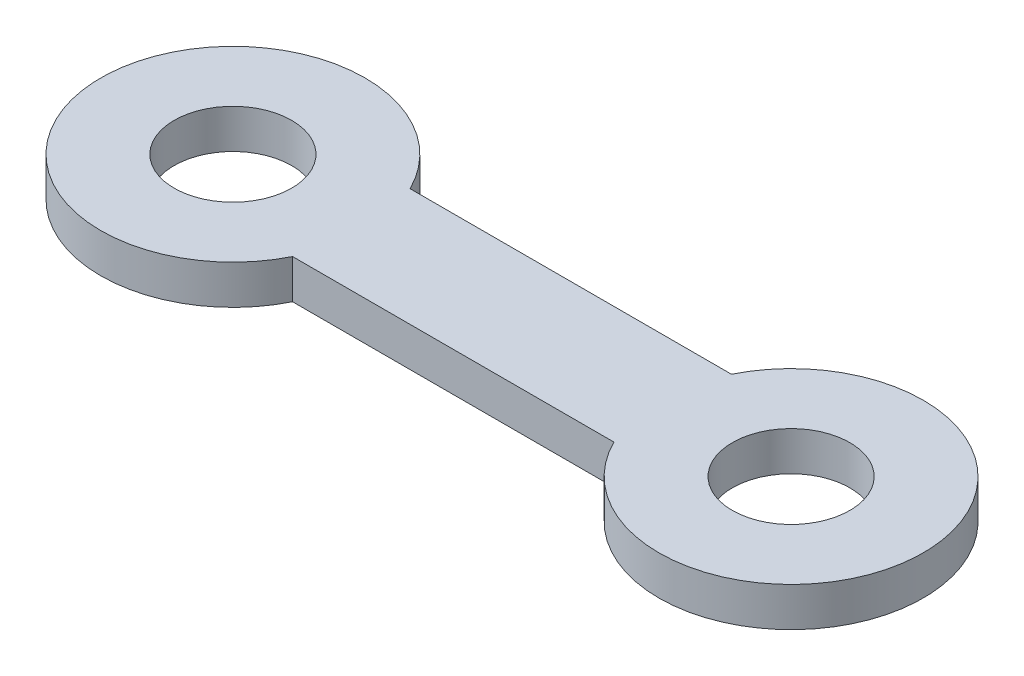
ISO-10303-21;
HEADER;
FILE_DESCRIPTION(('STEP AP214'),'2;1');
FILE_NAME('part.step','',(''),(''),'','','');
FILE_SCHEMA(('AUTOMOTIVE_DESIGN { 1 0 10303 214 1 1 1 1 }'));
ENDSEC;
DATA;
#1=APPLICATION_CONTEXT('core data for automotive mechanical design processes');
#2=APPLICATION_PROTOCOL_DEFINITION('international standard','automotive_design',2000,#1);
#3=PRODUCT_CONTEXT('',#1,'mechanical');
#4=PRODUCT('Part','Part','',(#3));
#5=PRODUCT_RELATED_PRODUCT_CATEGORY('part','',(#4));
#6=PRODUCT_DEFINITION_FORMATION('','',#4);
#7=PRODUCT_DEFINITION_CONTEXT('part definition',#1,'design');
#8=PRODUCT_DEFINITION('design','',#6,#7);
#9=PRODUCT_DEFINITION_SHAPE('','',#8);
#10=(LENGTH_UNIT() NAMED_UNIT(*) SI_UNIT(.MILLI.,.METRE.));
#11=(NAMED_UNIT(*) PLANE_ANGLE_UNIT() SI_UNIT($,.RADIAN.));
#12=(NAMED_UNIT(*) SI_UNIT($,.STERADIAN.) SOLID_ANGLE_UNIT());
#13=UNCERTAINTY_MEASURE_WITH_UNIT(LENGTH_MEASURE(1.E-05),#10,'distance_accuracy_value','');
#14=(GEOMETRIC_REPRESENTATION_CONTEXT(3) GLOBAL_UNCERTAINTY_ASSIGNED_CONTEXT((#13)) GLOBAL_UNIT_ASSIGNED_CONTEXT((#10,
#11,#12)) REPRESENTATION_CONTEXT('',''));
#15=CARTESIAN_POINT('',(0.,0.,0.));
#16=DIRECTION('',(0.,0.,1.));
#17=DIRECTION('',(1.,0.,0.));
#18=AXIS2_PLACEMENT_3D('',#15,#16,#17);
#19=CARTESIAN_POINT('',(-14.25,1.,0.));
#20=DIRECTION('',(0.,-1.,0.));
#21=DIRECTION('',(0.,0.,-1.));
#22=AXIS2_PLACEMENT_3D('',#19,#20,#21);
#23=PLANE('',#22);
#24=CARTESIAN_POINT('',(-14.25,1.,0.));
#25=DIRECTION('',(0.,1.,0.));
#26=DIRECTION('',(0.,0.,-1.));
#27=AXIS2_PLACEMENT_3D('',#24,#25,#26);
#28=CIRCLE('',#27,3.375);
#29=CARTESIAN_POINT('',(-11.226653344388,1.,-1.5));
#30=VERTEX_POINT('',#29);
#31=CARTESIAN_POINT('',(-11.226653344388,1.,1.5));
#32=VERTEX_POINT('',#31);
#33=EDGE_CURVE('E92',#30,#32,#28,.T.);
#34=ORIENTED_EDGE('',*,*,#33,.T.);
#35=DIRECTION('',(1.,0.,0.));
#36=VECTOR('',#35,1.);
#37=CARTESIAN_POINT('',(-11.226653344388,1.,1.5));
#38=LINE('',#37,#36);
#39=CARTESIAN_POINT('',(-3.02334665561196,1.,1.5));
#40=VERTEX_POINT('',#39);
#41=EDGE_CURVE('E87',#32,#40,#38,.T.);
#42=ORIENTED_EDGE('',*,*,#41,.T.);
#43=CARTESIAN_POINT('',(0.,1.,0.));
#44=DIRECTION('',(0.,1.,0.));
#45=DIRECTION('',(0.,0.,1.));
#46=AXIS2_PLACEMENT_3D('',#43,#44,#45);
#47=CIRCLE('',#46,3.375);
#48=CARTESIAN_POINT('',(-3.02334665561196,1.,-1.5));
#49=VERTEX_POINT('',#48);
#50=EDGE_CURVE('E90',#40,#49,#47,.T.);
#51=ORIENTED_EDGE('',*,*,#50,.T.);
#52=DIRECTION('',(-1.,0.,0.));
#53=VECTOR('',#52,1.);
#54=CARTESIAN_POINT('',(-3.02334665561196,1.,-1.5));
#55=LINE('',#54,#53);
#56=EDGE_CURVE('E57',#49,#30,#55,.T.);
#57=ORIENTED_EDGE('',*,*,#56,.T.);
#58=EDGE_LOOP('',(#34,#42,#51,#57));
#59=FACE_BOUND('',#58,.T.);
#60=CARTESIAN_POINT('',(0.,1.,0.));
#61=DIRECTION('',(0.,1.,0.));
#62=DIRECTION('',(0.,0.,1.));
#63=AXIS2_PLACEMENT_3D('',#60,#61,#62);
#64=CIRCLE('',#63,1.5);
#65=CARTESIAN_POINT('',(0.,1.,1.5));
#66=VERTEX_POINT('',#65);
#67=EDGE_CURVE('E112',#66,#66,#64,.T.);
#68=ORIENTED_EDGE('',*,*,#67,.F.);
#69=EDGE_LOOP('',(#68));
#70=FACE_BOUND('',#69,.T.);
#71=CARTESIAN_POINT('',(-14.25,1.,0.));
#72=DIRECTION('',(0.,1.,0.));
#73=DIRECTION('',(0.,0.,-1.));
#74=AXIS2_PLACEMENT_3D('',#71,#72,#73);
#75=CIRCLE('',#74,1.5);
#76=CARTESIAN_POINT('',(-14.25,1.,-1.5));
#77=VERTEX_POINT('',#76);
#78=EDGE_CURVE('E134',#77,#77,#75,.T.);
#79=ORIENTED_EDGE('',*,*,#78,.F.);
#80=EDGE_LOOP('',(#79));
#81=FACE_BOUND('',#80,.T.);
#82=ADVANCED_FACE('F39',(#59,#70,#81),#23,.F.);
#83=CARTESIAN_POINT('',(-14.25,0.,0.));
#84=DIRECTION('',(0.,-1.,0.));
#85=DIRECTION('',(0.,0.,-1.));
#86=AXIS2_PLACEMENT_3D('',#83,#84,#85);
#87=PLANE('',#86);
#88=CARTESIAN_POINT('',(0.,0.,0.));
#89=DIRECTION('',(0.,1.,0.));
#90=DIRECTION('',(0.,0.,1.));
#91=AXIS2_PLACEMENT_3D('',#88,#89,#90);
#92=CIRCLE('',#91,1.5);
#93=CARTESIAN_POINT('',(0.,0.,1.5));
#94=VERTEX_POINT('',#93);
#95=EDGE_CURVE('E130',#94,#94,#92,.T.);
#96=ORIENTED_EDGE('',*,*,#95,.T.);
#97=EDGE_LOOP('',(#96));
#98=FACE_BOUND('',#97,.T.);
#99=CARTESIAN_POINT('',(-14.25,0.,0.));
#100=DIRECTION('',(0.,1.,0.));
#101=DIRECTION('',(0.,0.,-1.));
#102=AXIS2_PLACEMENT_3D('',#99,#100,#101);
#103=CIRCLE('',#102,3.375);
#104=CARTESIAN_POINT('',(-11.226653344388,0.,-1.5));
#105=VERTEX_POINT('',#104);
#106=CARTESIAN_POINT('',(-11.226653344388,0.,1.5));
#107=VERTEX_POINT('',#106);
#108=EDGE_CURVE('E108',#105,#107,#103,.T.);
#109=ORIENTED_EDGE('',*,*,#108,.F.);
#110=DIRECTION('',(-1.,0.,0.));
#111=VECTOR('',#110,1.);
#112=CARTESIAN_POINT('',(-3.02334665561196,0.,-1.5));
#113=LINE('',#112,#111);
#114=CARTESIAN_POINT('',(-3.02334665561196,0.,-1.5));
#115=VERTEX_POINT('',#114);
#116=EDGE_CURVE('E80',#115,#105,#113,.T.);
#117=ORIENTED_EDGE('',*,*,#116,.F.);
#118=CARTESIAN_POINT('',(0.,0.,0.));
#119=DIRECTION('',(0.,1.,0.));
#120=DIRECTION('',(0.,0.,1.));
#121=AXIS2_PLACEMENT_3D('',#118,#119,#120);
#122=CIRCLE('',#121,3.375);
#123=CARTESIAN_POINT('',(-3.02334665561196,0.,1.5));
#124=VERTEX_POINT('',#123);
#125=EDGE_CURVE('E74',#124,#115,#122,.T.);
#126=ORIENTED_EDGE('',*,*,#125,.F.);
#127=DIRECTION('',(1.,0.,0.));
#128=VECTOR('',#127,1.);
#129=CARTESIAN_POINT('',(-11.226653344388,0.,1.5));
#130=LINE('',#129,#128);
#131=EDGE_CURVE('E97',#107,#124,#130,.T.);
#132=ORIENTED_EDGE('',*,*,#131,.F.);
#133=EDGE_LOOP('',(#109,#117,#126,#132));
#134=FACE_BOUND('',#133,.T.);
#135=CARTESIAN_POINT('',(-14.25,0.,0.));
#136=DIRECTION('',(0.,1.,0.));
#137=DIRECTION('',(0.,0.,-1.));
#138=AXIS2_PLACEMENT_3D('',#135,#136,#137);
#139=CIRCLE('',#138,1.5);
#140=CARTESIAN_POINT('',(-14.25,0.,-1.5));
#141=VERTEX_POINT('',#140);
#142=EDGE_CURVE('E138',#141,#141,#139,.T.);
#143=ORIENTED_EDGE('',*,*,#142,.T.);
#144=EDGE_LOOP('',(#143));
#145=FACE_BOUND('',#144,.T.);
#146=ADVANCED_FACE('F125',(#98,#134,#145),#87,.T.);
#147=CARTESIAN_POINT('',(-14.25,1.,0.));
#148=DIRECTION('',(0.,-1.,0.));
#149=DIRECTION('',(0.,0.,-1.));
#150=AXIS2_PLACEMENT_3D('',#147,#148,#149);
#151=CYLINDRICAL_SURFACE('',#150,3.375);
#152=ORIENTED_EDGE('',*,*,#108,.T.);
#153=DIRECTION('',(0.,-1.,0.));
#154=VECTOR('',#153,1.);
#155=CARTESIAN_POINT('',(-11.226653344388,1.,1.5));
#156=LINE('',#155,#154);
#157=EDGE_CURVE('E11',#32,#107,#156,.T.);
#158=ORIENTED_EDGE('',*,*,#157,.F.);
#159=ORIENTED_EDGE('',*,*,#33,.F.);
#160=DIRECTION('',(0.,-1.,0.));
#161=VECTOR('',#160,1.);
#162=CARTESIAN_POINT('',(-11.226653344388,1.,-1.5));
#163=LINE('',#162,#161);
#164=EDGE_CURVE('E104',#30,#105,#163,.T.);
#165=ORIENTED_EDGE('',*,*,#164,.T.);
#166=EDGE_LOOP('',(#152,#158,#159,#165));
#167=FACE_BOUND('',#166,.T.);
#168=ADVANCED_FACE('F41',(#167),#151,.T.);
#169=CARTESIAN_POINT('',(-11.226653344388,1.,1.5));
#170=DIRECTION('',(0.,0.,-1.));
#171=DIRECTION('',(-1.,0.,0.));
#172=AXIS2_PLACEMENT_3D('',#169,#170,#171);
#173=PLANE('',#172);
#174=ORIENTED_EDGE('',*,*,#131,.T.);
#175=DIRECTION('',(0.,-1.,0.));
#176=VECTOR('',#175,1.);
#177=CARTESIAN_POINT('',(-3.02334665561196,1.,1.5));
#178=LINE('',#177,#176);
#179=EDGE_CURVE('E49',#40,#124,#178,.T.);
#180=ORIENTED_EDGE('',*,*,#179,.F.);
#181=ORIENTED_EDGE('',*,*,#41,.F.);
#182=ORIENTED_EDGE('',*,*,#157,.T.);
#183=EDGE_LOOP('',(#174,#180,#181,#182));
#184=FACE_BOUND('',#183,.T.);
#185=ADVANCED_FACE('F96',(#184),#173,.F.);
#186=CARTESIAN_POINT('',(0.,1.,0.));
#187=DIRECTION('',(0.,-1.,0.));
#188=DIRECTION('',(0.,0.,-1.));
#189=AXIS2_PLACEMENT_3D('',#186,#187,#188);
#190=CYLINDRICAL_SURFACE('',#189,3.375);
#191=ORIENTED_EDGE('',*,*,#125,.T.);
#192=DIRECTION('',(0.,-1.,0.));
#193=VECTOR('',#192,1.);
#194=CARTESIAN_POINT('',(-3.02334665561196,1.,-1.5));
#195=LINE('',#194,#193);
#196=EDGE_CURVE('E99',#49,#115,#195,.T.);
#197=ORIENTED_EDGE('',*,*,#196,.F.);
#198=ORIENTED_EDGE('',*,*,#50,.F.);
#199=ORIENTED_EDGE('',*,*,#179,.T.);
#200=EDGE_LOOP('',(#191,#197,#198,#199));
#201=FACE_BOUND('',#200,.T.);
#202=ADVANCED_FACE('F100',(#201),#190,.T.);
#203=CARTESIAN_POINT('',(-3.02334665561196,1.,-1.5));
#204=DIRECTION('',(0.,0.,1.));
#205=DIRECTION('',(1.,0.,0.));
#206=AXIS2_PLACEMENT_3D('',#203,#204,#205);
#207=PLANE('',#206);
#208=ORIENTED_EDGE('',*,*,#116,.T.);
#209=ORIENTED_EDGE('',*,*,#164,.F.);
#210=ORIENTED_EDGE('',*,*,#56,.F.);
#211=ORIENTED_EDGE('',*,*,#196,.T.);
#212=EDGE_LOOP('',(#208,#209,#210,#211));
#213=FACE_BOUND('',#212,.T.);
#214=ADVANCED_FACE('F122',(#213),#207,.F.);
#215=CARTESIAN_POINT('',(0.,1.,0.));
#216=DIRECTION('',(0.,-1.,0.));
#217=DIRECTION('',(0.,0.,-1.));
#218=AXIS2_PLACEMENT_3D('',#215,#216,#217);
#219=CYLINDRICAL_SURFACE('',#218,1.5);
#220=ORIENTED_EDGE('',*,*,#67,.T.);
#221=EDGE_LOOP('',(#220));
#222=FACE_BOUND('',#221,.T.);
#223=ORIENTED_EDGE('',*,*,#95,.F.);
#224=EDGE_LOOP('',(#223));
#225=FACE_BOUND('',#224,.T.);
#226=ADVANCED_FACE('F157',(#222,#225),#219,.F.);
#227=CARTESIAN_POINT('',(-14.25,1.,0.));
#228=DIRECTION('',(0.,-1.,0.));
#229=DIRECTION('',(0.,0.,-1.));
#230=AXIS2_PLACEMENT_3D('',#227,#228,#229);
#231=CYLINDRICAL_SURFACE('',#230,1.5);
#232=ORIENTED_EDGE('',*,*,#78,.T.);
#233=EDGE_LOOP('',(#232));
#234=FACE_BOUND('',#233,.T.);
#235=ORIENTED_EDGE('',*,*,#142,.F.);
#236=EDGE_LOOP('',(#235));
#237=FACE_BOUND('',#236,.T.);
#238=ADVANCED_FACE('F146',(#234,#237),#231,.F.);
#239=CLOSED_SHELL('',(#82,#146,#168,#185,#202,#214,#226,#238));
#240=MANIFOLD_SOLID_BREP('B2',#239);
#241=ADVANCED_BREP_SHAPE_REPRESENTATION('',(#18,#240),#14);
#242=SHAPE_DEFINITION_REPRESENTATION(#9,#241);
ENDSEC;
END-ISO-10303-21;
